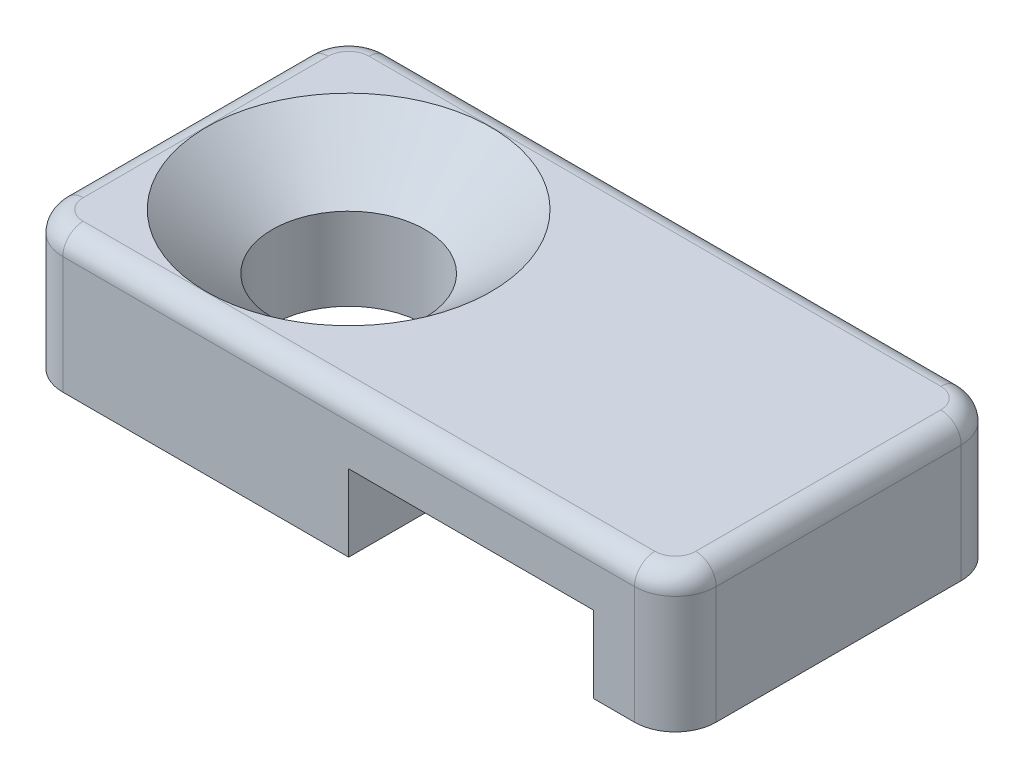
ISO-10303-21;
HEADER;
FILE_DESCRIPTION(('STEP AP214'),'2;1');
FILE_NAME('part.step','',(''),(''),'','','');
FILE_SCHEMA(('AUTOMOTIVE_DESIGN { 1 0 10303 214 1 1 1 1 }'));
ENDSEC;
DATA;
#1=APPLICATION_CONTEXT('core data for automotive mechanical design processes');
#2=APPLICATION_PROTOCOL_DEFINITION('international standard','automotive_design',2000,#1);
#3=PRODUCT_CONTEXT('',#1,'mechanical');
#4=PRODUCT('Part','Part','',(#3));
#5=PRODUCT_RELATED_PRODUCT_CATEGORY('part','',(#4));
#6=PRODUCT_DEFINITION_FORMATION('','',#4);
#7=PRODUCT_DEFINITION_CONTEXT('part definition',#1,'design');
#8=PRODUCT_DEFINITION('design','',#6,#7);
#9=PRODUCT_DEFINITION_SHAPE('','',#8);
#10=(LENGTH_UNIT() NAMED_UNIT(*) SI_UNIT(.MILLI.,.METRE.));
#11=(NAMED_UNIT(*) PLANE_ANGLE_UNIT() SI_UNIT($,.RADIAN.));
#12=(NAMED_UNIT(*) SI_UNIT($,.STERADIAN.) SOLID_ANGLE_UNIT());
#13=UNCERTAINTY_MEASURE_WITH_UNIT(LENGTH_MEASURE(1.E-05),#10,'distance_accuracy_value','');
#14=(GEOMETRIC_REPRESENTATION_CONTEXT(3) GLOBAL_UNCERTAINTY_ASSIGNED_CONTEXT((#13)) GLOBAL_UNIT_ASSIGNED_CONTEXT((#10,
#11,#12)) REPRESENTATION_CONTEXT('',''));
#15=CARTESIAN_POINT('',(0.,0.,0.));
#16=DIRECTION('',(0.,0.,1.));
#17=DIRECTION('',(1.,0.,0.));
#18=AXIS2_PLACEMENT_3D('',#15,#16,#17);
#19=CARTESIAN_POINT('',(-8.128,3.429,4.064));
#20=DIRECTION('',(0.,-1.,0.));
#21=DIRECTION('',(0.,0.,-1.));
#22=AXIS2_PLACEMENT_3D('',#19,#20,#21);
#23=PLANE('',#22);
#24=DIRECTION('',(-1.,0.,0.));
#25=VECTOR('',#24,1.);
#26=CARTESIAN_POINT('',(-8.128,3.429,3.556));
#27=LINE('',#26,#25);
#28=CARTESIAN_POINT('',(-7.112,3.429,3.556));
#29=VERTEX_POINT('',#28);
#30=CARTESIAN_POINT('',(7.112,3.429,3.556));
#31=VERTEX_POINT('',#30);
#32=EDGE_CURVE('E242',#29,#31,#27,.F.);
#33=ORIENTED_EDGE('',*,*,#32,.T.);
#34=CARTESIAN_POINT('',(7.112,3.429,3.048));
#35=DIRECTION('',(0.,-1.,0.));
#36=DIRECTION('',(0.,0.,-1.));
#37=AXIS2_PLACEMENT_3D('',#34,#35,#36);
#38=CIRCLE('',#37,0.508);
#39=CARTESIAN_POINT('',(7.62,3.429,3.048));
#40=VERTEX_POINT('',#39);
#41=EDGE_CURVE('E244',#31,#40,#38,.F.);
#42=ORIENTED_EDGE('',*,*,#41,.T.);
#43=DIRECTION('',(0.,0.,-1.));
#44=VECTOR('',#43,1.);
#45=CARTESIAN_POINT('',(7.62,3.429,4.064));
#46=LINE('',#45,#44);
#47=CARTESIAN_POINT('',(7.62,3.429,-3.048));
#48=VERTEX_POINT('',#47);
#49=EDGE_CURVE('E230',#40,#48,#46,.T.);
#50=ORIENTED_EDGE('',*,*,#49,.T.);
#51=CARTESIAN_POINT('',(7.112,3.429,-3.048));
#52=DIRECTION('',(0.,-1.,0.));
#53=DIRECTION('',(0.,0.,-1.));
#54=AXIS2_PLACEMENT_3D('',#51,#52,#53);
#55=CIRCLE('',#54,0.508);
#56=CARTESIAN_POINT('',(7.112,3.429,-3.556));
#57=VERTEX_POINT('',#56);
#58=EDGE_CURVE('E232',#48,#57,#55,.F.);
#59=ORIENTED_EDGE('',*,*,#58,.T.);
#60=DIRECTION('',(-1.,0.,0.));
#61=VECTOR('',#60,1.);
#62=CARTESIAN_POINT('',(-7.112,3.429,-3.556));
#63=LINE('',#62,#61);
#64=CARTESIAN_POINT('',(-7.112,3.429,-3.556));
#65=VERTEX_POINT('',#64);
#66=EDGE_CURVE('E234',#57,#65,#63,.T.);
#67=ORIENTED_EDGE('',*,*,#66,.T.);
#68=CARTESIAN_POINT('',(-7.112,3.429,-3.048));
#69=DIRECTION('',(0.,-1.,0.));
#70=DIRECTION('',(0.,0.,-1.));
#71=AXIS2_PLACEMENT_3D('',#68,#69,#70);
#72=CIRCLE('',#71,0.508);
#73=CARTESIAN_POINT('',(-7.62,3.429,-3.048));
#74=VERTEX_POINT('',#73);
#75=EDGE_CURVE('E236',#65,#74,#72,.F.);
#76=ORIENTED_EDGE('',*,*,#75,.T.);
#77=DIRECTION('',(0.,0.,-1.));
#78=VECTOR('',#77,1.);
#79=CARTESIAN_POINT('',(-7.62,3.429,4.064));
#80=LINE('',#79,#78);
#81=CARTESIAN_POINT('',(-7.62,3.429,3.048));
#82=VERTEX_POINT('',#81);
#83=EDGE_CURVE('E238',#74,#82,#80,.F.);
#84=ORIENTED_EDGE('',*,*,#83,.T.);
#85=CARTESIAN_POINT('',(-7.112,3.429,3.048));
#86=DIRECTION('',(0.,-1.,0.));
#87=DIRECTION('',(0.,0.,-1.));
#88=AXIS2_PLACEMENT_3D('',#85,#86,#87);
#89=CIRCLE('',#88,0.508);
#90=EDGE_CURVE('E240',#82,#29,#89,.F.);
#91=ORIENTED_EDGE('',*,*,#90,.T.);
#92=EDGE_LOOP('',(#33,#42,#50,#59,#67,#76,#84,#91));
#93=FACE_BOUND('',#92,.T.);
#94=CARTESIAN_POINT('',(-4.064,3.429,0.));
#95=DIRECTION('',(0.,1.,0.));
#96=DIRECTION('',(0.,0.,1.));
#97=AXIS2_PLACEMENT_3D('',#94,#95,#96);
#98=CIRCLE('',#97,3.5433);
#99=CARTESIAN_POINT('',(-4.064,3.429,3.5433));
#100=VERTEX_POINT('',#99);
#101=EDGE_CURVE('E281',#100,#100,#98,.T.);
#102=ORIENTED_EDGE('',*,*,#101,.F.);
#103=EDGE_LOOP('',(#102));
#104=FACE_BOUND('',#103,.T.);
#105=ADVANCED_FACE('F34',(#93,#104),#23,.F.);
#106=CARTESIAN_POINT('',(-8.128,0.,4.064));
#107=DIRECTION('',(1.,0.,0.));
#108=DIRECTION('',(0.,0.,-1.));
#109=AXIS2_PLACEMENT_3D('',#106,#107,#108);
#110=PLANE('',#109);
#111=DIRECTION('',(0.,-1.,0.));
#112=VECTOR('',#111,1.);
#113=CARTESIAN_POINT('',(-8.128,0.,3.048));
#114=LINE('',#113,#112);
#115=CARTESIAN_POINT('',(-8.128,0.,3.048));
#116=VERTEX_POINT('',#115);
#117=CARTESIAN_POINT('',(-8.128,2.921,3.048));
#118=VERTEX_POINT('',#117);
#119=EDGE_CURVE('E221',#116,#118,#114,.F.);
#120=ORIENTED_EDGE('',*,*,#119,.T.);
#121=DIRECTION('',(0.,0.,-1.));
#122=VECTOR('',#121,1.);
#123=CARTESIAN_POINT('',(-8.128,2.921,4.064));
#124=LINE('',#123,#122);
#125=CARTESIAN_POINT('',(-8.128,2.921,-3.048));
#126=VERTEX_POINT('',#125);
#127=EDGE_CURVE('E254',#118,#126,#124,.T.);
#128=ORIENTED_EDGE('',*,*,#127,.T.);
#129=DIRECTION('',(0.,-1.,0.));
#130=VECTOR('',#129,1.);
#131=CARTESIAN_POINT('',(-8.128,0.,-3.048));
#132=LINE('',#131,#130);
#133=CARTESIAN_POINT('',(-8.128,0.,-3.048));
#134=VERTEX_POINT('',#133);
#135=EDGE_CURVE('E224',#126,#134,#132,.T.);
#136=ORIENTED_EDGE('',*,*,#135,.T.);
#137=DIRECTION('',(0.,0.,-1.));
#138=VECTOR('',#137,1.);
#139=CARTESIAN_POINT('',(-8.128,0.,4.064));
#140=LINE('',#139,#138);
#141=EDGE_CURVE('E169',#116,#134,#140,.T.);
#142=ORIENTED_EDGE('',*,*,#141,.F.);
#143=EDGE_LOOP('',(#120,#128,#136,#142));
#144=FACE_BOUND('',#143,.T.);
#145=ADVANCED_FACE('F314',(#144),#110,.F.);
#146=CARTESIAN_POINT('',(0.,0.,4.064));
#147=DIRECTION('',(0.,1.,0.));
#148=DIRECTION('',(-1.,0.,0.));
#149=AXIS2_PLACEMENT_3D('',#146,#147,#148);
#150=PLANE('',#149);
#151=CARTESIAN_POINT('',(-4.064,0.,0.));
#152=DIRECTION('',(0.,1.,0.));
#153=DIRECTION('',(0.,0.,1.));
#154=AXIS2_PLACEMENT_3D('',#151,#152,#153);
#155=CIRCLE('',#154,1.89865);
#156=CARTESIAN_POINT('',(-4.064,0.,1.89865));
#157=VERTEX_POINT('',#156);
#158=EDGE_CURVE('E188',#157,#157,#155,.T.);
#159=ORIENTED_EDGE('',*,*,#158,.T.);
#160=EDGE_LOOP('',(#159));
#161=FACE_BOUND('',#160,.T.);
#162=ORIENTED_EDGE('',*,*,#141,.T.);
#163=CARTESIAN_POINT('',(-7.112,0.,-3.048));
#164=DIRECTION('',(0.,1.,0.));
#165=DIRECTION('',(-1.,0.,0.));
#166=AXIS2_PLACEMENT_3D('',#163,#164,#165);
#167=CIRCLE('',#166,1.016);
#168=CARTESIAN_POINT('',(-7.112,0.,-4.064));
#169=VERTEX_POINT('',#168);
#170=EDGE_CURVE('E228',#134,#169,#167,.F.);
#171=ORIENTED_EDGE('',*,*,#170,.T.);
#172=DIRECTION('',(1.,0.,0.));
#173=VECTOR('',#172,1.);
#174=CARTESIAN_POINT('',(0.,0.,-4.064));
#175=LINE('',#174,#173);
#176=CARTESIAN_POINT('',(0.,0.,-4.064));
#177=VERTEX_POINT('',#176);
#178=EDGE_CURVE('E166',#169,#177,#175,.T.);
#179=ORIENTED_EDGE('',*,*,#178,.T.);
#180=DIRECTION('',(0.,0.,-1.));
#181=VECTOR('',#180,1.);
#182=CARTESIAN_POINT('',(0.,0.,4.064));
#183=LINE('',#182,#181);
#184=CARTESIAN_POINT('',(0.,0.,4.064));
#185=VERTEX_POINT('',#184);
#186=EDGE_CURVE('E162',#185,#177,#183,.T.);
#187=ORIENTED_EDGE('',*,*,#186,.F.);
#188=DIRECTION('',(1.,0.,0.));
#189=VECTOR('',#188,1.);
#190=CARTESIAN_POINT('',(0.,0.,4.064));
#191=LINE('',#190,#189);
#192=CARTESIAN_POINT('',(-7.112,0.,4.064));
#193=VERTEX_POINT('',#192);
#194=EDGE_CURVE('E148',#193,#185,#191,.T.);
#195=ORIENTED_EDGE('',*,*,#194,.F.);
#196=CARTESIAN_POINT('',(-7.112,0.,3.048));
#197=DIRECTION('',(0.,1.,0.));
#198=DIRECTION('',(-1.,0.,0.));
#199=AXIS2_PLACEMENT_3D('',#196,#197,#198);
#200=CIRCLE('',#199,1.016);
#201=EDGE_CURVE('E226',#193,#116,#200,.F.);
#202=ORIENTED_EDGE('',*,*,#201,.T.);
#203=EDGE_LOOP('',(#162,#171,#179,#187,#195,#202));
#204=FACE_BOUND('',#203,.T.);
#205=ADVANCED_FACE('F164',(#161,#204),#150,.F.);
#206=CARTESIAN_POINT('',(0.,0.,4.064));
#207=DIRECTION('',(-1.,0.,0.));
#208=DIRECTION('',(0.,0.,1.));
#209=AXIS2_PLACEMENT_3D('',#206,#207,#208);
#210=PLANE('',#209);
#211=DIRECTION('',(0.,1.,0.));
#212=VECTOR('',#211,1.);
#213=CARTESIAN_POINT('',(0.,0.,-4.064));
#214=LINE('',#213,#212);
#215=CARTESIAN_POINT('',(0.,1.905,-4.064));
#216=VERTEX_POINT('',#215);
#217=EDGE_CURVE('E187',#177,#216,#214,.T.);
#218=ORIENTED_EDGE('',*,*,#217,.T.);
#219=DIRECTION('',(0.,0.,-1.));
#220=VECTOR('',#219,1.);
#221=CARTESIAN_POINT('',(0.,1.905,4.064));
#222=LINE('',#221,#220);
#223=CARTESIAN_POINT('',(0.,1.905,4.064));
#224=VERTEX_POINT('',#223);
#225=EDGE_CURVE('E170',#224,#216,#222,.T.);
#226=ORIENTED_EDGE('',*,*,#225,.F.);
#227=DIRECTION('',(0.,1.,0.));
#228=VECTOR('',#227,1.);
#229=CARTESIAN_POINT('',(0.,0.,4.064));
#230=LINE('',#229,#228);
#231=EDGE_CURVE('E153',#185,#224,#230,.T.);
#232=ORIENTED_EDGE('',*,*,#231,.F.);
#233=ORIENTED_EDGE('',*,*,#186,.T.);
#234=EDGE_LOOP('',(#218,#226,#232,#233));
#235=FACE_BOUND('',#234,.T.);
#236=ADVANCED_FACE('F172',(#235),#210,.F.);
#237=CARTESIAN_POINT('',(0.,1.905,4.064));
#238=DIRECTION('',(0.,1.,0.));
#239=DIRECTION('',(0.,0.,1.));
#240=AXIS2_PLACEMENT_3D('',#237,#238,#239);
#241=PLANE('',#240);
#242=DIRECTION('',(1.,0.,0.));
#243=VECTOR('',#242,1.);
#244=CARTESIAN_POINT('',(0.,1.905,-4.064));
#245=LINE('',#244,#243);
#246=CARTESIAN_POINT('',(6.096,1.905,-4.064));
#247=VERTEX_POINT('',#246);
#248=EDGE_CURVE('E190',#216,#247,#245,.T.);
#249=ORIENTED_EDGE('',*,*,#248,.T.);
#250=DIRECTION('',(0.,0.,-1.));
#251=VECTOR('',#250,1.);
#252=CARTESIAN_POINT('',(6.096,1.905,4.064));
#253=LINE('',#252,#251);
#254=CARTESIAN_POINT('',(6.096,1.905,4.064));
#255=VERTEX_POINT('',#254);
#256=EDGE_CURVE('E201',#255,#247,#253,.T.);
#257=ORIENTED_EDGE('',*,*,#256,.F.);
#258=DIRECTION('',(1.,0.,0.));
#259=VECTOR('',#258,1.);
#260=CARTESIAN_POINT('',(0.,1.905,4.064));
#261=LINE('',#260,#259);
#262=EDGE_CURVE('E175',#224,#255,#261,.T.);
#263=ORIENTED_EDGE('',*,*,#262,.F.);
#264=ORIENTED_EDGE('',*,*,#225,.T.);
#265=EDGE_LOOP('',(#249,#257,#263,#264));
#266=FACE_BOUND('',#265,.T.);
#267=ADVANCED_FACE('F397',(#266),#241,.F.);
#268=CARTESIAN_POINT('',(6.096,0.,4.064));
#269=DIRECTION('',(1.,0.,0.));
#270=DIRECTION('',(0.,0.,-1.));
#271=AXIS2_PLACEMENT_3D('',#268,#269,#270);
#272=PLANE('',#271);
#273=DIRECTION('',(0.,-1.,0.));
#274=VECTOR('',#273,1.);
#275=CARTESIAN_POINT('',(6.096,0.,-4.064));
#276=LINE('',#275,#274);
#277=CARTESIAN_POINT('',(6.096,0.,-4.064));
#278=VERTEX_POINT('',#277);
#279=EDGE_CURVE('E192',#247,#278,#276,.T.);
#280=ORIENTED_EDGE('',*,*,#279,.T.);
#281=DIRECTION('',(0.,0.,-1.));
#282=VECTOR('',#281,1.);
#283=CARTESIAN_POINT('',(6.096,0.,4.064));
#284=LINE('',#283,#282);
#285=CARTESIAN_POINT('',(6.096,0.,4.064));
#286=VERTEX_POINT('',#285);
#287=EDGE_CURVE('E198',#286,#278,#284,.T.);
#288=ORIENTED_EDGE('',*,*,#287,.F.);
#289=DIRECTION('',(0.,-1.,0.));
#290=VECTOR('',#289,1.);
#291=CARTESIAN_POINT('',(6.096,0.,4.064));
#292=LINE('',#291,#290);
#293=EDGE_CURVE('E177',#255,#286,#292,.T.);
#294=ORIENTED_EDGE('',*,*,#293,.F.);
#295=ORIENTED_EDGE('',*,*,#256,.T.);
#296=EDGE_LOOP('',(#280,#288,#294,#295));
#297=FACE_BOUND('',#296,.T.);
#298=ADVANCED_FACE('F403',(#297),#272,.F.);
#299=CARTESIAN_POINT('',(8.128,0.,4.064));
#300=DIRECTION('',(0.,1.,0.));
#301=DIRECTION('',(-1.,0.,0.));
#302=AXIS2_PLACEMENT_3D('',#299,#300,#301);
#303=PLANE('',#302);
#304=DIRECTION('',(1.,0.,0.));
#305=VECTOR('',#304,1.);
#306=CARTESIAN_POINT('',(8.128,0.,-4.064));
#307=LINE('',#306,#305);
#308=CARTESIAN_POINT('',(7.112,0.,-4.064));
#309=VERTEX_POINT('',#308);
#310=EDGE_CURVE('E159',#278,#309,#307,.T.);
#311=ORIENTED_EDGE('',*,*,#310,.T.);
#312=CARTESIAN_POINT('',(7.112,0.,-3.048));
#313=DIRECTION('',(0.,1.,0.));
#314=DIRECTION('',(-1.,0.,0.));
#315=AXIS2_PLACEMENT_3D('',#312,#313,#314);
#316=CIRCLE('',#315,1.016);
#317=CARTESIAN_POINT('',(8.128,0.,-3.048));
#318=VERTEX_POINT('',#317);
#319=EDGE_CURVE('E216',#309,#318,#316,.F.);
#320=ORIENTED_EDGE('',*,*,#319,.T.);
#321=DIRECTION('',(0.,0.,-1.));
#322=VECTOR('',#321,1.);
#323=CARTESIAN_POINT('',(8.128,0.,4.064));
#324=LINE('',#323,#322);
#325=CARTESIAN_POINT('',(8.128,0.,3.048));
#326=VERTEX_POINT('',#325);
#327=EDGE_CURVE('E185',#326,#318,#324,.T.);
#328=ORIENTED_EDGE('',*,*,#327,.F.);
#329=CARTESIAN_POINT('',(7.112,0.,3.048));
#330=DIRECTION('',(0.,1.,0.));
#331=DIRECTION('',(-1.,0.,0.));
#332=AXIS2_PLACEMENT_3D('',#329,#330,#331);
#333=CIRCLE('',#332,1.016);
#334=CARTESIAN_POINT('',(7.112,0.,4.064));
#335=VERTEX_POINT('',#334);
#336=EDGE_CURVE('E214',#326,#335,#333,.F.);
#337=ORIENTED_EDGE('',*,*,#336,.T.);
#338=DIRECTION('',(1.,0.,0.));
#339=VECTOR('',#338,1.);
#340=CARTESIAN_POINT('',(8.128,0.,4.064));
#341=LINE('',#340,#339);
#342=EDGE_CURVE('E182',#286,#335,#341,.T.);
#343=ORIENTED_EDGE('',*,*,#342,.F.);
#344=ORIENTED_EDGE('',*,*,#287,.T.);
#345=EDGE_LOOP('',(#311,#320,#328,#337,#343,#344));
#346=FACE_BOUND('',#345,.T.);
#347=ADVANCED_FACE('F406',(#346),#303,.F.);
#348=CARTESIAN_POINT('',(8.128,3.429,4.064));
#349=DIRECTION('',(-1.,0.,0.));
#350=DIRECTION('',(0.,0.,1.));
#351=AXIS2_PLACEMENT_3D('',#348,#349,#350);
#352=PLANE('',#351);
#353=DIRECTION('',(0.,1.,0.));
#354=VECTOR('',#353,1.);
#355=CARTESIAN_POINT('',(8.128,3.429,-3.048));
#356=LINE('',#355,#354);
#357=CARTESIAN_POINT('',(8.128,2.921,-3.048));
#358=VERTEX_POINT('',#357);
#359=EDGE_CURVE('E208',#318,#358,#356,.T.);
#360=ORIENTED_EDGE('',*,*,#359,.T.);
#361=DIRECTION('',(0.,0.,-1.));
#362=VECTOR('',#361,1.);
#363=CARTESIAN_POINT('',(8.128,2.921,4.064));
#364=LINE('',#363,#362);
#365=CARTESIAN_POINT('',(8.128,2.921,3.048));
#366=VERTEX_POINT('',#365);
#367=EDGE_CURVE('E11',#358,#366,#364,.F.);
#368=ORIENTED_EDGE('',*,*,#367,.T.);
#369=DIRECTION('',(0.,1.,0.));
#370=VECTOR('',#369,1.);
#371=CARTESIAN_POINT('',(8.128,3.429,3.048));
#372=LINE('',#371,#370);
#373=EDGE_CURVE('E206',#366,#326,#372,.F.);
#374=ORIENTED_EDGE('',*,*,#373,.T.);
#375=ORIENTED_EDGE('',*,*,#327,.T.);
#376=EDGE_LOOP('',(#360,#368,#374,#375));
#377=FACE_BOUND('',#376,.T.);
#378=ADVANCED_FACE('F376',(#377),#352,.F.);
#379=CARTESIAN_POINT('',(0.,0.,4.064));
#380=DIRECTION('',(0.,0.,-1.));
#381=DIRECTION('',(-1.,0.,0.));
#382=AXIS2_PLACEMENT_3D('',#379,#380,#381);
#383=PLANE('',#382);
#384=DIRECTION('',(0.,1.,0.));
#385=VECTOR('',#384,1.);
#386=CARTESIAN_POINT('',(7.112,0.,4.064));
#387=LINE('',#386,#385);
#388=CARTESIAN_POINT('',(7.112,2.921,4.064));
#389=VERTEX_POINT('',#388);
#390=EDGE_CURVE('E219',#335,#389,#387,.T.);
#391=ORIENTED_EDGE('',*,*,#390,.T.);
#392=DIRECTION('',(-1.,0.,0.));
#393=VECTOR('',#392,1.);
#394=CARTESIAN_POINT('',(0.,2.921,4.064));
#395=LINE('',#394,#393);
#396=CARTESIAN_POINT('',(-7.112,2.921,4.064));
#397=VERTEX_POINT('',#396);
#398=EDGE_CURVE('E250',#389,#397,#395,.T.);
#399=ORIENTED_EDGE('',*,*,#398,.T.);
#400=DIRECTION('',(0.,-1.,0.));
#401=VECTOR('',#400,1.);
#402=CARTESIAN_POINT('',(-7.112,0.,4.064));
#403=LINE('',#402,#401);
#404=EDGE_CURVE('E156',#397,#193,#403,.T.);
#405=ORIENTED_EDGE('',*,*,#404,.T.);
#406=ORIENTED_EDGE('',*,*,#194,.T.);
#407=ORIENTED_EDGE('',*,*,#231,.T.);
#408=ORIENTED_EDGE('',*,*,#262,.T.);
#409=ORIENTED_EDGE('',*,*,#293,.T.);
#410=ORIENTED_EDGE('',*,*,#342,.T.);
#411=EDGE_LOOP('',(#391,#399,#405,#406,#407,#408,#409,#410));
#412=FACE_BOUND('',#411,.T.);
#413=ADVANCED_FACE('F151',(#412),#383,.F.);
#414=CARTESIAN_POINT('',(0.,0.,-4.064));
#415=DIRECTION('',(0.,0.,-1.));
#416=DIRECTION('',(-1.,0.,0.));
#417=AXIS2_PLACEMENT_3D('',#414,#415,#416);
#418=PLANE('',#417);
#419=DIRECTION('',(0.,-1.,0.));
#420=VECTOR('',#419,1.);
#421=CARTESIAN_POINT('',(-7.112,3.429,-4.064));
#422=LINE('',#421,#420);
#423=CARTESIAN_POINT('',(-7.112,2.921,-4.064));
#424=VERTEX_POINT('',#423);
#425=EDGE_CURVE('E210',#169,#424,#422,.F.);
#426=ORIENTED_EDGE('',*,*,#425,.T.);
#427=DIRECTION('',(-1.,0.,0.));
#428=VECTOR('',#427,1.);
#429=CARTESIAN_POINT('',(7.112,2.921,-4.064));
#430=LINE('',#429,#428);
#431=CARTESIAN_POINT('',(7.112,2.921,-4.064));
#432=VERTEX_POINT('',#431);
#433=EDGE_CURVE('E58',#424,#432,#430,.F.);
#434=ORIENTED_EDGE('',*,*,#433,.T.);
#435=DIRECTION('',(0.,1.,0.));
#436=VECTOR('',#435,1.);
#437=CARTESIAN_POINT('',(7.112,0.,-4.064));
#438=LINE('',#437,#436);
#439=EDGE_CURVE('E212',#432,#309,#438,.F.);
#440=ORIENTED_EDGE('',*,*,#439,.T.);
#441=ORIENTED_EDGE('',*,*,#310,.F.);
#442=ORIENTED_EDGE('',*,*,#279,.F.);
#443=ORIENTED_EDGE('',*,*,#248,.F.);
#444=ORIENTED_EDGE('',*,*,#217,.F.);
#445=ORIENTED_EDGE('',*,*,#178,.F.);
#446=EDGE_LOOP('',(#426,#434,#440,#441,#442,#443,#444,#445));
#447=FACE_BOUND('',#446,.T.);
#448=ADVANCED_FACE('F301',(#447),#418,.T.);
#449=CARTESIAN_POINT('',(-4.064,3.429,0.));
#450=DIRECTION('',(0.,1.,0.));
#451=DIRECTION('',(0.,0.,1.));
#452=AXIS2_PLACEMENT_3D('',#449,#450,#451);
#453=CYLINDRICAL_SURFACE('',#452,1.89865);
#454=ORIENTED_EDGE('',*,*,#158,.F.);
#455=EDGE_LOOP('',(#454));
#456=FACE_BOUND('',#455,.T.);
#457=CARTESIAN_POINT('',(-4.064,2.04897479158428,0.));
#458=DIRECTION('',(0.,1.,0.));
#459=DIRECTION('',(0.,0.,1.));
#460=AXIS2_PLACEMENT_3D('',#457,#458,#459);
#461=CIRCLE('',#460,1.89865);
#462=CARTESIAN_POINT('',(-4.064,2.04897479158428,1.89865));
#463=VERTEX_POINT('',#462);
#464=EDGE_CURVE('E287',#463,#463,#461,.T.);
#465=ORIENTED_EDGE('',*,*,#464,.T.);
#466=EDGE_LOOP('',(#465));
#467=FACE_BOUND('',#466,.T.);
#468=ADVANCED_FACE('F297',(#456,#467),#453,.F.);
#469=CARTESIAN_POINT('',(-4.064,3.429,0.));
#470=DIRECTION('',(0.,1.,0.));
#471=DIRECTION('',(0.,0.,1.));
#472=AXIS2_PLACEMENT_3D('',#469,#470,#471);
#473=CONICAL_SURFACE('',#472,3.5433,0.872664625997165);
#474=ORIENTED_EDGE('',*,*,#464,.F.);
#475=EDGE_LOOP('',(#474));
#476=FACE_BOUND('',#475,.T.);
#477=ORIENTED_EDGE('',*,*,#101,.T.);
#478=EDGE_LOOP('',(#477));
#479=FACE_BOUND('',#478,.T.);
#480=ADVANCED_FACE('F300',(#476,#479),#473,.F.);
#481=CARTESIAN_POINT('',(7.112,3.429,-3.048));
#482=DIRECTION('',(0.,-1.,0.));
#483=DIRECTION('',(0.,0.,-1.));
#484=AXIS2_PLACEMENT_3D('',#481,#482,#483);
#485=CYLINDRICAL_SURFACE('',#484,1.016);
#486=ORIENTED_EDGE('',*,*,#439,.F.);
#487=CARTESIAN_POINT('',(7.112,2.921,-3.048));
#488=DIRECTION('',(0.,-1.,0.));
#489=DIRECTION('',(0.,0.,-1.));
#490=AXIS2_PLACEMENT_3D('',#487,#488,#489);
#491=CIRCLE('',#490,1.016);
#492=EDGE_CURVE('E43',#432,#358,#491,.T.);
#493=ORIENTED_EDGE('',*,*,#492,.T.);
#494=ORIENTED_EDGE('',*,*,#359,.F.);
#495=ORIENTED_EDGE('',*,*,#319,.F.);
#496=EDGE_LOOP('',(#486,#493,#494,#495));
#497=FACE_BOUND('',#496,.T.);
#498=ADVANCED_FACE('F306',(#497),#485,.T.);
#499=CARTESIAN_POINT('',(7.112,0.,3.048));
#500=DIRECTION('',(0.,1.,0.));
#501=DIRECTION('',(0.,0.,1.));
#502=AXIS2_PLACEMENT_3D('',#499,#500,#501);
#503=CYLINDRICAL_SURFACE('',#502,1.016);
#504=ORIENTED_EDGE('',*,*,#373,.F.);
#505=CARTESIAN_POINT('',(7.112,2.921,3.048));
#506=DIRECTION('',(0.,-1.,0.));
#507=DIRECTION('',(0.,0.,-1.));
#508=AXIS2_PLACEMENT_3D('',#505,#506,#507);
#509=CIRCLE('',#508,1.016);
#510=EDGE_CURVE('E247',#366,#389,#509,.T.);
#511=ORIENTED_EDGE('',*,*,#510,.T.);
#512=ORIENTED_EDGE('',*,*,#390,.F.);
#513=ORIENTED_EDGE('',*,*,#336,.F.);
#514=EDGE_LOOP('',(#504,#511,#512,#513));
#515=FACE_BOUND('',#514,.T.);
#516=ADVANCED_FACE('F311',(#515),#503,.T.);
#517=CARTESIAN_POINT('',(-7.112,0.,-3.048));
#518=DIRECTION('',(0.,1.,0.));
#519=DIRECTION('',(0.,0.,1.));
#520=AXIS2_PLACEMENT_3D('',#517,#518,#519);
#521=CYLINDRICAL_SURFACE('',#520,1.016);
#522=ORIENTED_EDGE('',*,*,#135,.F.);
#523=CARTESIAN_POINT('',(-7.112,2.921,-3.048));
#524=DIRECTION('',(0.,-1.,0.));
#525=DIRECTION('',(0.,0.,-1.));
#526=AXIS2_PLACEMENT_3D('',#523,#524,#525);
#527=CIRCLE('',#526,1.016);
#528=EDGE_CURVE('E256',#126,#424,#527,.T.);
#529=ORIENTED_EDGE('',*,*,#528,.T.);
#530=ORIENTED_EDGE('',*,*,#425,.F.);
#531=ORIENTED_EDGE('',*,*,#170,.F.);
#532=EDGE_LOOP('',(#522,#529,#530,#531));
#533=FACE_BOUND('',#532,.T.);
#534=ADVANCED_FACE('F327',(#533),#521,.T.);
#535=CARTESIAN_POINT('',(-7.112,0.,3.048));
#536=DIRECTION('',(0.,-1.,0.));
#537=DIRECTION('',(0.,0.,-1.));
#538=AXIS2_PLACEMENT_3D('',#535,#536,#537);
#539=CYLINDRICAL_SURFACE('',#538,1.016);
#540=ORIENTED_EDGE('',*,*,#404,.F.);
#541=CARTESIAN_POINT('',(-7.112,2.921,3.048));
#542=DIRECTION('',(0.,-1.,0.));
#543=DIRECTION('',(0.,0.,-1.));
#544=AXIS2_PLACEMENT_3D('',#541,#542,#543);
#545=CIRCLE('',#544,1.016);
#546=EDGE_CURVE('E252',#397,#118,#545,.T.);
#547=ORIENTED_EDGE('',*,*,#546,.T.);
#548=ORIENTED_EDGE('',*,*,#119,.F.);
#549=ORIENTED_EDGE('',*,*,#201,.F.);
#550=EDGE_LOOP('',(#540,#547,#548,#549));
#551=FACE_BOUND('',#550,.T.);
#552=ADVANCED_FACE('F331',(#551),#539,.T.);
#553=CARTESIAN_POINT('',(-7.112,2.921,-3.048));
#554=DIRECTION('',(0.,-1.,0.));
#555=DIRECTION('',(0.,0.,-1.));
#556=AXIS2_PLACEMENT_3D('',#553,#554,#555);
#557=DEGENERATE_TOROIDAL_SURFACE('',#556,0.508,0.508,.T.);
#558=CARTESIAN_POINT('',(-7.112,2.921,-3.556));
#559=DIRECTION('',(1.,0.,0.));
#560=DIRECTION('',(0.,0.,-1.));
#561=AXIS2_PLACEMENT_3D('',#558,#559,#560);
#562=CIRCLE('',#561,0.508);
#563=EDGE_CURVE('E275',#424,#65,#562,.T.);
#564=ORIENTED_EDGE('',*,*,#563,.F.);
#565=ORIENTED_EDGE('',*,*,#528,.F.);
#566=CARTESIAN_POINT('',(-7.62,2.921,-3.048));
#567=DIRECTION('',(0.,0.,1.));
#568=DIRECTION('',(1.,0.,0.));
#569=AXIS2_PLACEMENT_3D('',#566,#567,#568);
#570=CIRCLE('',#569,0.508);
#571=EDGE_CURVE('E38',#74,#126,#570,.T.);
#572=ORIENTED_EDGE('',*,*,#571,.F.);
#573=ORIENTED_EDGE('',*,*,#75,.F.);
#574=EDGE_LOOP('',(#564,#565,#572,#573));
#575=FACE_BOUND('',#574,.T.);
#576=ADVANCED_FACE('F36',(#575),#557,.T.);
#577=CARTESIAN_POINT('',(-7.62,2.921,4.064));
#578=DIRECTION('',(0.,0.,-1.));
#579=DIRECTION('',(-1.,0.,0.));
#580=AXIS2_PLACEMENT_3D('',#577,#578,#579);
#581=CYLINDRICAL_SURFACE('',#580,0.508);
#582=ORIENTED_EDGE('',*,*,#571,.T.);
#583=ORIENTED_EDGE('',*,*,#127,.F.);
#584=CARTESIAN_POINT('',(-7.62,2.921,3.048));
#585=DIRECTION('',(0.,0.,1.));
#586=DIRECTION('',(1.,0.,0.));
#587=AXIS2_PLACEMENT_3D('',#584,#585,#586);
#588=CIRCLE('',#587,0.508);
#589=EDGE_CURVE('E273',#82,#118,#588,.T.);
#590=ORIENTED_EDGE('',*,*,#589,.F.);
#591=ORIENTED_EDGE('',*,*,#83,.F.);
#592=EDGE_LOOP('',(#582,#583,#590,#591));
#593=FACE_BOUND('',#592,.T.);
#594=ADVANCED_FACE('F358',(#593),#581,.T.);
#595=CARTESIAN_POINT('',(-8.128,2.921,-3.556));
#596=DIRECTION('',(1.,0.,0.));
#597=DIRECTION('',(0.,0.,-1.));
#598=AXIS2_PLACEMENT_3D('',#595,#596,#597);
#599=CYLINDRICAL_SURFACE('',#598,0.508);
#600=ORIENTED_EDGE('',*,*,#563,.T.);
#601=ORIENTED_EDGE('',*,*,#66,.F.);
#602=CARTESIAN_POINT('',(7.112,2.921,-3.556));
#603=DIRECTION('',(1.,0.,0.));
#604=DIRECTION('',(0.,0.,-1.));
#605=AXIS2_PLACEMENT_3D('',#602,#603,#604);
#606=CIRCLE('',#605,0.508);
#607=EDGE_CURVE('E270',#432,#57,#606,.T.);
#608=ORIENTED_EDGE('',*,*,#607,.F.);
#609=ORIENTED_EDGE('',*,*,#433,.F.);
#610=EDGE_LOOP('',(#600,#601,#608,#609));
#611=FACE_BOUND('',#610,.T.);
#612=ADVANCED_FACE('F355',(#611),#599,.T.);
#613=CARTESIAN_POINT('',(-7.112,2.921,3.048));
#614=DIRECTION('',(0.,-1.,0.));
#615=DIRECTION('',(0.,0.,-1.));
#616=AXIS2_PLACEMENT_3D('',#613,#614,#615);
#617=DEGENERATE_TOROIDAL_SURFACE('',#616,0.508,0.508,.T.);
#618=ORIENTED_EDGE('',*,*,#589,.T.);
#619=ORIENTED_EDGE('',*,*,#546,.F.);
#620=CARTESIAN_POINT('',(-7.112,2.921,3.556));
#621=DIRECTION('',(1.,0.,0.));
#622=DIRECTION('',(0.,0.,-1.));
#623=AXIS2_PLACEMENT_3D('',#620,#621,#622);
#624=CIRCLE('',#623,0.508);
#625=EDGE_CURVE('E267',#29,#397,#624,.T.);
#626=ORIENTED_EDGE('',*,*,#625,.F.);
#627=ORIENTED_EDGE('',*,*,#90,.F.);
#628=EDGE_LOOP('',(#618,#619,#626,#627));
#629=FACE_BOUND('',#628,.T.);
#630=ADVANCED_FACE('F351',(#629),#617,.T.);
#631=CARTESIAN_POINT('',(7.112,2.921,-3.048));
#632=DIRECTION('',(0.,-1.,0.));
#633=DIRECTION('',(0.,0.,-1.));
#634=AXIS2_PLACEMENT_3D('',#631,#632,#633);
#635=DEGENERATE_TOROIDAL_SURFACE('',#634,0.508,0.508,.T.);
#636=ORIENTED_EDGE('',*,*,#607,.T.);
#637=ORIENTED_EDGE('',*,*,#58,.F.);
#638=CARTESIAN_POINT('',(7.62,2.921,-3.048));
#639=DIRECTION('',(0.,0.,1.));
#640=DIRECTION('',(1.,0.,0.));
#641=AXIS2_PLACEMENT_3D('',#638,#639,#640);
#642=CIRCLE('',#641,0.508);
#643=EDGE_CURVE('E264',#358,#48,#642,.T.);
#644=ORIENTED_EDGE('',*,*,#643,.F.);
#645=ORIENTED_EDGE('',*,*,#492,.F.);
#646=EDGE_LOOP('',(#636,#637,#644,#645));
#647=FACE_BOUND('',#646,.T.);
#648=ADVANCED_FACE('F347',(#647),#635,.T.);
#649=CARTESIAN_POINT('',(0.,2.921,3.556));
#650=DIRECTION('',(-1.,0.,0.));
#651=DIRECTION('',(0.,0.,1.));
#652=AXIS2_PLACEMENT_3D('',#649,#650,#651);
#653=CYLINDRICAL_SURFACE('',#652,0.508);
#654=ORIENTED_EDGE('',*,*,#625,.T.);
#655=ORIENTED_EDGE('',*,*,#398,.F.);
#656=CARTESIAN_POINT('',(7.112,2.921,3.556));
#657=DIRECTION('',(1.,0.,0.));
#658=DIRECTION('',(0.,0.,-1.));
#659=AXIS2_PLACEMENT_3D('',#656,#657,#658);
#660=CIRCLE('',#659,0.508);
#661=EDGE_CURVE('E262',#31,#389,#660,.T.);
#662=ORIENTED_EDGE('',*,*,#661,.F.);
#663=ORIENTED_EDGE('',*,*,#32,.F.);
#664=EDGE_LOOP('',(#654,#655,#662,#663));
#665=FACE_BOUND('',#664,.T.);
#666=ADVANCED_FACE('F343',(#665),#653,.T.);
#667=CARTESIAN_POINT('',(7.62,2.921,4.064));
#668=DIRECTION('',(0.,0.,-1.));
#669=DIRECTION('',(-1.,0.,0.));
#670=AXIS2_PLACEMENT_3D('',#667,#668,#669);
#671=CYLINDRICAL_SURFACE('',#670,0.508);
#672=ORIENTED_EDGE('',*,*,#643,.T.);
#673=ORIENTED_EDGE('',*,*,#49,.F.);
#674=CARTESIAN_POINT('',(7.62,2.921,3.048));
#675=DIRECTION('',(0.,0.,1.));
#676=DIRECTION('',(1.,0.,0.));
#677=AXIS2_PLACEMENT_3D('',#674,#675,#676);
#678=CIRCLE('',#677,0.508);
#679=EDGE_CURVE('E260',#366,#40,#678,.T.);
#680=ORIENTED_EDGE('',*,*,#679,.F.);
#681=ORIENTED_EDGE('',*,*,#367,.F.);
#682=EDGE_LOOP('',(#672,#673,#680,#681));
#683=FACE_BOUND('',#682,.T.);
#684=ADVANCED_FACE('F339',(#683),#671,.T.);
#685=CARTESIAN_POINT('',(7.112,2.921,3.048));
#686=DIRECTION('',(0.,-1.,0.));
#687=DIRECTION('',(0.,0.,-1.));
#688=AXIS2_PLACEMENT_3D('',#685,#686,#687);
#689=DEGENERATE_TOROIDAL_SURFACE('',#688,0.508,0.508,.T.);
#690=ORIENTED_EDGE('',*,*,#661,.T.);
#691=ORIENTED_EDGE('',*,*,#510,.F.);
#692=ORIENTED_EDGE('',*,*,#679,.T.);
#693=ORIENTED_EDGE('',*,*,#41,.F.);
#694=EDGE_LOOP('',(#690,#691,#692,#693));
#695=FACE_BOUND('',#694,.T.);
#696=ADVANCED_FACE('F336',(#695),#689,.T.);
#697=CLOSED_SHELL('',(#105,#145,#205,#236,#267,#298,#347,#378,#413,#448,#468,#480,#498,#516,
#534,#552,#576,#594,#612,#630,#648,#666,#684,#696));
#698=MANIFOLD_SOLID_BREP('B2',#697);
#699=ADVANCED_BREP_SHAPE_REPRESENTATION('',(#18,#698),#14);
#700=SHAPE_DEFINITION_REPRESENTATION(#9,#699);
ENDSEC;
END-ISO-10303-21;
